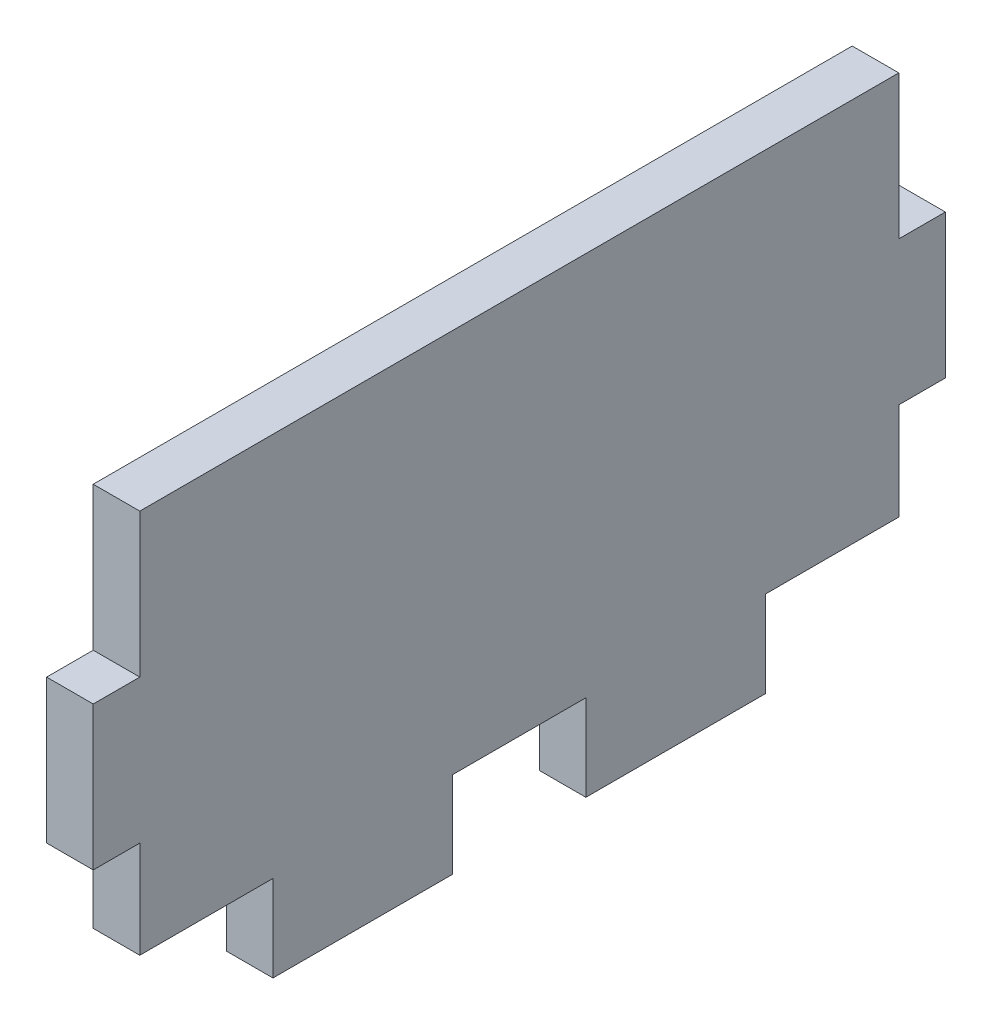
ISO-10303-21;
HEADER;
FILE_DESCRIPTION(('STEP AP214'),'2;1');
FILE_NAME('part.step','',(''),(''),'','','');
FILE_SCHEMA(('AUTOMOTIVE_DESIGN { 1 0 10303 214 1 1 1 1 }'));
ENDSEC;
DATA;
#1=APPLICATION_CONTEXT('core data for automotive mechanical design processes');
#2=APPLICATION_PROTOCOL_DEFINITION('international standard','automotive_design',2000,#1);
#3=PRODUCT_CONTEXT('',#1,'mechanical');
#4=PRODUCT('Part','Part','',(#3));
#5=PRODUCT_RELATED_PRODUCT_CATEGORY('part','',(#4));
#6=PRODUCT_DEFINITION_FORMATION('','',#4);
#7=PRODUCT_DEFINITION_CONTEXT('part definition',#1,'design');
#8=PRODUCT_DEFINITION('design','',#6,#7);
#9=PRODUCT_DEFINITION_SHAPE('','',#8);
#10=(LENGTH_UNIT() NAMED_UNIT(*) SI_UNIT(.MILLI.,.METRE.));
#11=(NAMED_UNIT(*) PLANE_ANGLE_UNIT() SI_UNIT($,.RADIAN.));
#12=(NAMED_UNIT(*) SI_UNIT($,.STERADIAN.) SOLID_ANGLE_UNIT());
#13=UNCERTAINTY_MEASURE_WITH_UNIT(LENGTH_MEASURE(1.E-05),#10,'distance_accuracy_value','');
#14=(GEOMETRIC_REPRESENTATION_CONTEXT(3) GLOBAL_UNCERTAINTY_ASSIGNED_CONTEXT((#13)) GLOBAL_UNIT_ASSIGNED_CONTEXT((#10,
#11,#12)) REPRESENTATION_CONTEXT('',''));
#15=CARTESIAN_POINT('',(0.,0.,0.));
#16=DIRECTION('',(0.,0.,1.));
#17=DIRECTION('',(1.,0.,0.));
#18=AXIS2_PLACEMENT_3D('',#15,#16,#17);
#19=CARTESIAN_POINT('',(2.7,4.16666666666667,-22.));
#20=DIRECTION('',(0.,0.,1.));
#21=DIRECTION('',(0.,-1.,0.));
#22=AXIS2_PLACEMENT_3D('',#19,#20,#21);
#23=PLANE('',#22);
#24=DIRECTION('',(0.,1.,0.));
#25=VECTOR('',#24,1.);
#26=CARTESIAN_POINT('',(0.,4.16666666666667,-22.));
#27=LINE('',#26,#25);
#28=CARTESIAN_POINT('',(0.,4.16666666666667,-22.));
#29=VERTEX_POINT('',#28);
#30=CARTESIAN_POINT('',(0.,12.5,-22.));
#31=VERTEX_POINT('',#30);
#32=EDGE_CURVE('E201',#29,#31,#27,.T.);
#33=ORIENTED_EDGE('',*,*,#32,.T.);
#34=DIRECTION('',(-1.,0.,0.));
#35=VECTOR('',#34,1.);
#36=CARTESIAN_POINT('',(2.7,12.5,-22.));
#37=LINE('',#36,#35);
#38=CARTESIAN_POINT('',(2.7,12.5,-22.));
#39=VERTEX_POINT('',#38);
#40=EDGE_CURVE('E11',#39,#31,#37,.T.);
#41=ORIENTED_EDGE('',*,*,#40,.F.);
#42=DIRECTION('',(0.,1.,0.));
#43=VECTOR('',#42,1.);
#44=CARTESIAN_POINT('',(2.7,4.16666666666667,-22.));
#45=LINE('',#44,#43);
#46=CARTESIAN_POINT('',(2.7,4.16666666666667,-22.));
#47=VERTEX_POINT('',#46);
#48=EDGE_CURVE('E243',#47,#39,#45,.T.);
#49=ORIENTED_EDGE('',*,*,#48,.F.);
#50=DIRECTION('',(-1.,0.,0.));
#51=VECTOR('',#50,1.);
#52=CARTESIAN_POINT('',(2.7,4.16666666666667,-22.));
#53=LINE('',#52,#51);
#54=EDGE_CURVE('E197',#47,#29,#53,.T.);
#55=ORIENTED_EDGE('',*,*,#54,.T.);
#56=EDGE_LOOP('',(#33,#41,#49,#55));
#57=FACE_BOUND('',#56,.T.);
#58=ADVANCED_FACE('F33',(#57),#23,.F.);
#59=CARTESIAN_POINT('',(2.7,12.5,-22.));
#60=DIRECTION('',(0.,-1.,0.));
#61=DIRECTION('',(0.,0.,-1.));
#62=AXIS2_PLACEMENT_3D('',#59,#60,#61);
#63=PLANE('',#62);
#64=DIRECTION('',(0.,0.,1.));
#65=VECTOR('',#64,1.);
#66=CARTESIAN_POINT('',(0.,12.5,-22.));
#67=LINE('',#66,#65);
#68=CARTESIAN_POINT('',(0.,12.5,22.));
#69=VERTEX_POINT('',#68);
#70=EDGE_CURVE('E204',#31,#69,#67,.T.);
#71=ORIENTED_EDGE('',*,*,#70,.T.);
#72=DIRECTION('',(-1.,0.,0.));
#73=VECTOR('',#72,1.);
#74=CARTESIAN_POINT('',(2.7,12.5,22.));
#75=LINE('',#74,#73);
#76=CARTESIAN_POINT('',(2.7,12.5,22.));
#77=VERTEX_POINT('',#76);
#78=EDGE_CURVE('E41',#77,#69,#75,.T.);
#79=ORIENTED_EDGE('',*,*,#78,.F.);
#80=DIRECTION('',(0.,0.,1.));
#81=VECTOR('',#80,1.);
#82=CARTESIAN_POINT('',(2.7,12.5,-22.));
#83=LINE('',#82,#81);
#84=EDGE_CURVE('E128',#39,#77,#83,.T.);
#85=ORIENTED_EDGE('',*,*,#84,.F.);
#86=ORIENTED_EDGE('',*,*,#40,.T.);
#87=EDGE_LOOP('',(#71,#79,#85,#86));
#88=FACE_BOUND('',#87,.T.);
#89=ADVANCED_FACE('F361',(#88),#63,.F.);
#90=CARTESIAN_POINT('',(2.7,4.16666666666665,22.));
#91=DIRECTION('',(0.,0.,-1.));
#92=DIRECTION('',(-1.,0.,0.));
#93=AXIS2_PLACEMENT_3D('',#90,#91,#92);
#94=PLANE('',#93);
#95=DIRECTION('',(0.,-1.,0.));
#96=VECTOR('',#95,1.);
#97=CARTESIAN_POINT('',(0.,4.16666666666665,22.));
#98=LINE('',#97,#96);
#99=CARTESIAN_POINT('',(0.,4.16666666666665,22.));
#100=VERTEX_POINT('',#99);
#101=EDGE_CURVE('E206',#69,#100,#98,.T.);
#102=ORIENTED_EDGE('',*,*,#101,.T.);
#103=DIRECTION('',(-1.,0.,0.));
#104=VECTOR('',#103,1.);
#105=CARTESIAN_POINT('',(2.7,4.16666666666665,22.));
#106=LINE('',#105,#104);
#107=CARTESIAN_POINT('',(2.7,4.16666666666665,22.));
#108=VERTEX_POINT('',#107);
#109=EDGE_CURVE('E286',#108,#100,#106,.T.);
#110=ORIENTED_EDGE('',*,*,#109,.F.);
#111=DIRECTION('',(0.,-1.,0.));
#112=VECTOR('',#111,1.);
#113=CARTESIAN_POINT('',(2.7,4.16666666666665,22.));
#114=LINE('',#113,#112);
#115=EDGE_CURVE('E294',#77,#108,#114,.T.);
#116=ORIENTED_EDGE('',*,*,#115,.F.);
#117=ORIENTED_EDGE('',*,*,#78,.T.);
#118=EDGE_LOOP('',(#102,#110,#116,#117));
#119=FACE_BOUND('',#118,.T.);
#120=ADVANCED_FACE('F292',(#119),#94,.F.);
#121=CARTESIAN_POINT('',(2.7,4.16666666666665,24.7));
#122=DIRECTION('',(0.,-1.,0.));
#123=DIRECTION('',(0.,0.,-1.));
#124=AXIS2_PLACEMENT_3D('',#121,#122,#123);
#125=PLANE('',#124);
#126=DIRECTION('',(0.,0.,1.));
#127=VECTOR('',#126,1.);
#128=CARTESIAN_POINT('',(0.,4.16666666666665,24.7));
#129=LINE('',#128,#127);
#130=CARTESIAN_POINT('',(0.,4.16666666666665,24.7));
#131=VERTEX_POINT('',#130);
#132=EDGE_CURVE('E208',#100,#131,#129,.T.);
#133=ORIENTED_EDGE('',*,*,#132,.T.);
#134=DIRECTION('',(-1.,0.,0.));
#135=VECTOR('',#134,1.);
#136=CARTESIAN_POINT('',(2.7,4.16666666666665,24.7));
#137=LINE('',#136,#135);
#138=CARTESIAN_POINT('',(2.7,4.16666666666665,24.7));
#139=VERTEX_POINT('',#138);
#140=EDGE_CURVE('E283',#139,#131,#137,.T.);
#141=ORIENTED_EDGE('',*,*,#140,.F.);
#142=DIRECTION('',(0.,0.,1.));
#143=VECTOR('',#142,1.);
#144=CARTESIAN_POINT('',(2.7,4.16666666666665,24.7));
#145=LINE('',#144,#143);
#146=EDGE_CURVE('E312',#108,#139,#145,.T.);
#147=ORIENTED_EDGE('',*,*,#146,.F.);
#148=ORIENTED_EDGE('',*,*,#109,.T.);
#149=EDGE_LOOP('',(#133,#141,#147,#148));
#150=FACE_BOUND('',#149,.T.);
#151=ADVANCED_FACE('F303',(#150),#125,.F.);
#152=CARTESIAN_POINT('',(2.7,-4.16666666666668,24.7));
#153=DIRECTION('',(0.,0.,-1.));
#154=DIRECTION('',(-1.,0.,0.));
#155=AXIS2_PLACEMENT_3D('',#152,#153,#154);
#156=PLANE('',#155);
#157=DIRECTION('',(0.,-1.,0.));
#158=VECTOR('',#157,1.);
#159=CARTESIAN_POINT('',(0.,-4.16666666666668,24.7));
#160=LINE('',#159,#158);
#161=CARTESIAN_POINT('',(0.,-4.16666666666668,24.7));
#162=VERTEX_POINT('',#161);
#163=EDGE_CURVE('E210',#131,#162,#160,.T.);
#164=ORIENTED_EDGE('',*,*,#163,.T.);
#165=DIRECTION('',(-1.,0.,0.));
#166=VECTOR('',#165,1.);
#167=CARTESIAN_POINT('',(2.7,-4.16666666666668,24.7));
#168=LINE('',#167,#166);
#169=CARTESIAN_POINT('',(2.7,-4.16666666666668,24.7));
#170=VERTEX_POINT('',#169);
#171=EDGE_CURVE('E280',#170,#162,#168,.T.);
#172=ORIENTED_EDGE('',*,*,#171,.F.);
#173=DIRECTION('',(0.,-1.,0.));
#174=VECTOR('',#173,1.);
#175=CARTESIAN_POINT('',(2.7,-4.16666666666668,24.7));
#176=LINE('',#175,#174);
#177=EDGE_CURVE('E309',#139,#170,#176,.T.);
#178=ORIENTED_EDGE('',*,*,#177,.F.);
#179=ORIENTED_EDGE('',*,*,#140,.T.);
#180=EDGE_LOOP('',(#164,#172,#178,#179));
#181=FACE_BOUND('',#180,.T.);
#182=ADVANCED_FACE('F307',(#181),#156,.F.);
#183=CARTESIAN_POINT('',(2.7,-4.16666666666668,24.7));
#184=DIRECTION('',(0.,1.,0.));
#185=DIRECTION('',(0.,0.,1.));
#186=AXIS2_PLACEMENT_3D('',#183,#184,#185);
#187=PLANE('',#186);
#188=DIRECTION('',(0.,0.,-1.));
#189=VECTOR('',#188,1.);
#190=CARTESIAN_POINT('',(0.,-4.16666666666668,24.7));
#191=LINE('',#190,#189);
#192=CARTESIAN_POINT('',(0.,-4.16666666666668,22.));
#193=VERTEX_POINT('',#192);
#194=EDGE_CURVE('E212',#162,#193,#191,.T.);
#195=ORIENTED_EDGE('',*,*,#194,.T.);
#196=DIRECTION('',(-1.,0.,0.));
#197=VECTOR('',#196,1.);
#198=CARTESIAN_POINT('',(2.7,-4.16666666666668,22.));
#199=LINE('',#198,#197);
#200=CARTESIAN_POINT('',(2.7,-4.16666666666668,22.));
#201=VERTEX_POINT('',#200);
#202=EDGE_CURVE('E277',#201,#193,#199,.T.);
#203=ORIENTED_EDGE('',*,*,#202,.F.);
#204=DIRECTION('',(0.,0.,-1.));
#205=VECTOR('',#204,1.);
#206=CARTESIAN_POINT('',(2.7,-4.16666666666668,24.7));
#207=LINE('',#206,#205);
#208=EDGE_CURVE('E311',#170,#201,#207,.T.);
#209=ORIENTED_EDGE('',*,*,#208,.F.);
#210=ORIENTED_EDGE('',*,*,#171,.T.);
#211=EDGE_LOOP('',(#195,#203,#209,#210));
#212=FACE_BOUND('',#211,.T.);
#213=ADVANCED_FACE('F374',(#212),#187,.F.);
#214=CARTESIAN_POINT('',(2.7,-4.16666666666668,22.));
#215=DIRECTION('',(0.,0.,-1.));
#216=DIRECTION('',(-1.,0.,0.));
#217=AXIS2_PLACEMENT_3D('',#214,#215,#216);
#218=PLANE('',#217);
#219=DIRECTION('',(0.,-1.,0.));
#220=VECTOR('',#219,1.);
#221=CARTESIAN_POINT('',(0.,-4.16666666666668,22.));
#222=LINE('',#221,#220);
#223=CARTESIAN_POINT('',(0.,-9.80000000000001,22.));
#224=VERTEX_POINT('',#223);
#225=EDGE_CURVE('E214',#193,#224,#222,.T.);
#226=ORIENTED_EDGE('',*,*,#225,.T.);
#227=DIRECTION('',(-1.,0.,0.));
#228=VECTOR('',#227,1.);
#229=CARTESIAN_POINT('',(2.7,-9.80000000000001,22.));
#230=LINE('',#229,#228);
#231=CARTESIAN_POINT('',(2.7,-9.80000000000001,22.));
#232=VERTEX_POINT('',#231);
#233=EDGE_CURVE('E274',#232,#224,#230,.T.);
#234=ORIENTED_EDGE('',*,*,#233,.F.);
#235=DIRECTION('',(0.,-1.,0.));
#236=VECTOR('',#235,1.);
#237=CARTESIAN_POINT('',(2.7,-4.16666666666668,22.));
#238=LINE('',#237,#236);
#239=EDGE_CURVE('E314',#201,#232,#238,.T.);
#240=ORIENTED_EDGE('',*,*,#239,.F.);
#241=ORIENTED_EDGE('',*,*,#202,.T.);
#242=EDGE_LOOP('',(#226,#234,#240,#241));
#243=FACE_BOUND('',#242,.T.);
#244=ADVANCED_FACE('F377',(#243),#218,.F.);
#245=CARTESIAN_POINT('',(2.7,-9.80000000000001,22.));
#246=DIRECTION('',(0.,1.,0.));
#247=DIRECTION('',(0.,0.,1.));
#248=AXIS2_PLACEMENT_3D('',#245,#246,#247);
#249=PLANE('',#248);
#250=DIRECTION('',(0.,0.,-1.));
#251=VECTOR('',#250,1.);
#252=CARTESIAN_POINT('',(0.,-9.80000000000001,22.));
#253=LINE('',#252,#251);
#254=CARTESIAN_POINT('',(0.,-9.80000000000001,14.28));
#255=VERTEX_POINT('',#254);
#256=EDGE_CURVE('E216',#224,#255,#253,.T.);
#257=ORIENTED_EDGE('',*,*,#256,.T.);
#258=DIRECTION('',(-1.,0.,0.));
#259=VECTOR('',#258,1.);
#260=CARTESIAN_POINT('',(2.7,-9.80000000000001,14.28));
#261=LINE('',#260,#259);
#262=CARTESIAN_POINT('',(2.7,-9.80000000000001,14.28));
#263=VERTEX_POINT('',#262);
#264=EDGE_CURVE('E271',#263,#255,#261,.T.);
#265=ORIENTED_EDGE('',*,*,#264,.F.);
#266=DIRECTION('',(0.,0.,-1.));
#267=VECTOR('',#266,1.);
#268=CARTESIAN_POINT('',(2.7,-9.80000000000001,22.));
#269=LINE('',#268,#267);
#270=EDGE_CURVE('E320',#232,#263,#269,.T.);
#271=ORIENTED_EDGE('',*,*,#270,.F.);
#272=ORIENTED_EDGE('',*,*,#233,.T.);
#273=EDGE_LOOP('',(#257,#265,#271,#272));
#274=FACE_BOUND('',#273,.T.);
#275=ADVANCED_FACE('F381',(#274),#249,.F.);
#276=CARTESIAN_POINT('',(2.7,-12.5,14.28));
#277=DIRECTION('',(0.,0.,-1.));
#278=DIRECTION('',(-1.,0.,0.));
#279=AXIS2_PLACEMENT_3D('',#276,#277,#278);
#280=PLANE('',#279);
#281=DIRECTION('',(0.,-1.,0.));
#282=VECTOR('',#281,1.);
#283=CARTESIAN_POINT('',(0.,-12.5,14.28));
#284=LINE('',#283,#282);
#285=CARTESIAN_POINT('',(0.,-14.8,14.28));
#286=VERTEX_POINT('',#285);
#287=EDGE_CURVE('E219',#255,#286,#284,.T.);
#288=ORIENTED_EDGE('',*,*,#287,.T.);
#289=DIRECTION('',(-1.,0.,0.));
#290=VECTOR('',#289,1.);
#291=CARTESIAN_POINT('',(2.7,-14.8,14.28));
#292=LINE('',#291,#290);
#293=CARTESIAN_POINT('',(2.7,-14.8,14.28));
#294=VERTEX_POINT('',#293);
#295=EDGE_CURVE('E268',#294,#286,#292,.T.);
#296=ORIENTED_EDGE('',*,*,#295,.F.);
#297=DIRECTION('',(0.,-1.,0.));
#298=VECTOR('',#297,1.);
#299=CARTESIAN_POINT('',(2.7,-12.5,14.28));
#300=LINE('',#299,#298);
#301=EDGE_CURVE('E322',#263,#294,#300,.T.);
#302=ORIENTED_EDGE('',*,*,#301,.F.);
#303=ORIENTED_EDGE('',*,*,#264,.T.);
#304=EDGE_LOOP('',(#288,#296,#302,#303));
#305=FACE_BOUND('',#304,.T.);
#306=ADVANCED_FACE('F385',(#305),#280,.F.);
#307=CARTESIAN_POINT('',(2.7,-14.8,14.28));
#308=DIRECTION('',(0.,1.,0.));
#309=DIRECTION('',(0.,0.,1.));
#310=AXIS2_PLACEMENT_3D('',#307,#308,#309);
#311=PLANE('',#310);
#312=DIRECTION('',(0.,0.,-1.));
#313=VECTOR('',#312,1.);
#314=CARTESIAN_POINT('',(0.,-14.8,14.28));
#315=LINE('',#314,#313);
#316=CARTESIAN_POINT('',(0.,-14.8,3.85999999999999));
#317=VERTEX_POINT('',#316);
#318=EDGE_CURVE('E221',#286,#317,#315,.T.);
#319=ORIENTED_EDGE('',*,*,#318,.T.);
#320=DIRECTION('',(-1.,0.,0.));
#321=VECTOR('',#320,1.);
#322=CARTESIAN_POINT('',(2.7,-14.8,3.85999999999999));
#323=LINE('',#322,#321);
#324=CARTESIAN_POINT('',(2.7,-14.8,3.85999999999999));
#325=VERTEX_POINT('',#324);
#326=EDGE_CURVE('E265',#325,#317,#323,.T.);
#327=ORIENTED_EDGE('',*,*,#326,.F.);
#328=DIRECTION('',(0.,0.,-1.));
#329=VECTOR('',#328,1.);
#330=CARTESIAN_POINT('',(2.7,-14.8,14.28));
#331=LINE('',#330,#329);
#332=EDGE_CURVE('E324',#294,#325,#331,.T.);
#333=ORIENTED_EDGE('',*,*,#332,.F.);
#334=ORIENTED_EDGE('',*,*,#295,.T.);
#335=EDGE_LOOP('',(#319,#327,#333,#334));
#336=FACE_BOUND('',#335,.T.);
#337=ADVANCED_FACE('F389',(#336),#311,.F.);
#338=CARTESIAN_POINT('',(2.7,-9.80000000000001,3.85999999999999));
#339=DIRECTION('',(0.,0.,1.));
#340=DIRECTION('',(1.,0.,0.));
#341=AXIS2_PLACEMENT_3D('',#338,#339,#340);
#342=PLANE('',#341);
#343=DIRECTION('',(0.,1.,0.));
#344=VECTOR('',#343,1.);
#345=CARTESIAN_POINT('',(0.,-9.80000000000001,3.85999999999999));
#346=LINE('',#345,#344);
#347=CARTESIAN_POINT('',(0.,-9.80000000000001,3.85999999999999));
#348=VERTEX_POINT('',#347);
#349=EDGE_CURVE('E224',#317,#348,#346,.T.);
#350=ORIENTED_EDGE('',*,*,#349,.T.);
#351=DIRECTION('',(-1.,0.,0.));
#352=VECTOR('',#351,1.);
#353=CARTESIAN_POINT('',(2.7,-9.80000000000001,3.85999999999999));
#354=LINE('',#353,#352);
#355=CARTESIAN_POINT('',(2.7,-9.80000000000001,3.85999999999999));
#356=VERTEX_POINT('',#355);
#357=EDGE_CURVE('E262',#356,#348,#354,.T.);
#358=ORIENTED_EDGE('',*,*,#357,.F.);
#359=DIRECTION('',(0.,1.,0.));
#360=VECTOR('',#359,1.);
#361=CARTESIAN_POINT('',(2.7,-12.5,3.85999999999999));
#362=LINE('',#361,#360);
#363=EDGE_CURVE('E326',#325,#356,#362,.T.);
#364=ORIENTED_EDGE('',*,*,#363,.F.);
#365=ORIENTED_EDGE('',*,*,#326,.T.);
#366=EDGE_LOOP('',(#350,#358,#364,#365));
#367=FACE_BOUND('',#366,.T.);
#368=ADVANCED_FACE('F393',(#367),#342,.F.);
#369=CARTESIAN_POINT('',(2.7,-9.80000000000001,3.85999999999999));
#370=DIRECTION('',(0.,1.,0.));
#371=DIRECTION('',(0.,0.,1.));
#372=AXIS2_PLACEMENT_3D('',#369,#370,#371);
#373=PLANE('',#372);
#374=DIRECTION('',(0.,0.,-1.));
#375=VECTOR('',#374,1.);
#376=CARTESIAN_POINT('',(0.,-9.80000000000001,3.85999999999999));
#377=LINE('',#376,#375);
#378=CARTESIAN_POINT('',(0.,-9.8,-3.86000000000001));
#379=VERTEX_POINT('',#378);
#380=EDGE_CURVE('E226',#348,#379,#377,.T.);
#381=ORIENTED_EDGE('',*,*,#380,.T.);
#382=DIRECTION('',(-1.,0.,0.));
#383=VECTOR('',#382,1.);
#384=CARTESIAN_POINT('',(2.7,-9.8,-3.86000000000001));
#385=LINE('',#384,#383);
#386=CARTESIAN_POINT('',(2.7,-9.8,-3.86000000000001));
#387=VERTEX_POINT('',#386);
#388=EDGE_CURVE('E259',#387,#379,#385,.T.);
#389=ORIENTED_EDGE('',*,*,#388,.F.);
#390=DIRECTION('',(0.,0.,-1.));
#391=VECTOR('',#390,1.);
#392=CARTESIAN_POINT('',(2.7,-9.80000000000001,3.85999999999999));
#393=LINE('',#392,#391);
#394=EDGE_CURVE('E328',#356,#387,#393,.T.);
#395=ORIENTED_EDGE('',*,*,#394,.F.);
#396=ORIENTED_EDGE('',*,*,#357,.T.);
#397=EDGE_LOOP('',(#381,#389,#395,#396));
#398=FACE_BOUND('',#397,.T.);
#399=ADVANCED_FACE('F397',(#398),#373,.F.);
#400=CARTESIAN_POINT('',(2.7,-12.5,-3.86000000000001));
#401=DIRECTION('',(0.,0.,-1.));
#402=DIRECTION('',(0.,1.,0.));
#403=AXIS2_PLACEMENT_3D('',#400,#401,#402);
#404=PLANE('',#403);
#405=DIRECTION('',(0.,-1.,0.));
#406=VECTOR('',#405,1.);
#407=CARTESIAN_POINT('',(0.,-12.5,-3.86000000000001));
#408=LINE('',#407,#406);
#409=CARTESIAN_POINT('',(0.,-14.8,-3.86000000000001));
#410=VERTEX_POINT('',#409);
#411=EDGE_CURVE('E229',#379,#410,#408,.T.);
#412=ORIENTED_EDGE('',*,*,#411,.T.);
#413=DIRECTION('',(-1.,0.,0.));
#414=VECTOR('',#413,1.);
#415=CARTESIAN_POINT('',(2.7,-14.8,-3.86000000000001));
#416=LINE('',#415,#414);
#417=CARTESIAN_POINT('',(2.7,-14.8,-3.86000000000001));
#418=VERTEX_POINT('',#417);
#419=EDGE_CURVE('E256',#418,#410,#416,.T.);
#420=ORIENTED_EDGE('',*,*,#419,.F.);
#421=DIRECTION('',(0.,-1.,0.));
#422=VECTOR('',#421,1.);
#423=CARTESIAN_POINT('',(2.7,-9.8,-3.86000000000001));
#424=LINE('',#423,#422);
#425=EDGE_CURVE('E330',#387,#418,#424,.T.);
#426=ORIENTED_EDGE('',*,*,#425,.F.);
#427=ORIENTED_EDGE('',*,*,#388,.T.);
#428=EDGE_LOOP('',(#412,#420,#426,#427));
#429=FACE_BOUND('',#428,.T.);
#430=ADVANCED_FACE('F401',(#429),#404,.F.);
#431=CARTESIAN_POINT('',(2.7,-14.8,-3.86000000000001));
#432=DIRECTION('',(0.,1.,0.));
#433=DIRECTION('',(0.,0.,1.));
#434=AXIS2_PLACEMENT_3D('',#431,#432,#433);
#435=PLANE('',#434);
#436=DIRECTION('',(0.,0.,-1.));
#437=VECTOR('',#436,1.);
#438=CARTESIAN_POINT('',(0.,-14.8,-3.86000000000001));
#439=LINE('',#438,#437);
#440=CARTESIAN_POINT('',(0.,-14.8,-14.28));
#441=VERTEX_POINT('',#440);
#442=EDGE_CURVE('E231',#410,#441,#439,.T.);
#443=ORIENTED_EDGE('',*,*,#442,.T.);
#444=DIRECTION('',(-1.,0.,0.));
#445=VECTOR('',#444,1.);
#446=CARTESIAN_POINT('',(2.7,-14.8,-14.28));
#447=LINE('',#446,#445);
#448=CARTESIAN_POINT('',(2.7,-14.8,-14.28));
#449=VERTEX_POINT('',#448);
#450=EDGE_CURVE('E253',#449,#441,#447,.T.);
#451=ORIENTED_EDGE('',*,*,#450,.F.);
#452=DIRECTION('',(0.,0.,-1.));
#453=VECTOR('',#452,1.);
#454=CARTESIAN_POINT('',(2.7,-14.8,-3.86000000000001));
#455=LINE('',#454,#453);
#456=EDGE_CURVE('E332',#418,#449,#455,.T.);
#457=ORIENTED_EDGE('',*,*,#456,.F.);
#458=ORIENTED_EDGE('',*,*,#419,.T.);
#459=EDGE_LOOP('',(#443,#451,#457,#458));
#460=FACE_BOUND('',#459,.T.);
#461=ADVANCED_FACE('F405',(#460),#435,.F.);
#462=CARTESIAN_POINT('',(2.7,-12.5,-14.28));
#463=DIRECTION('',(0.,0.,1.));
#464=DIRECTION('',(0.,-1.,0.));
#465=AXIS2_PLACEMENT_3D('',#462,#463,#464);
#466=PLANE('',#465);
#467=DIRECTION('',(0.,1.,0.));
#468=VECTOR('',#467,1.);
#469=CARTESIAN_POINT('',(0.,-12.5,-14.28));
#470=LINE('',#469,#468);
#471=CARTESIAN_POINT('',(0.,-9.8,-14.28));
#472=VERTEX_POINT('',#471);
#473=EDGE_CURVE('E234',#441,#472,#470,.T.);
#474=ORIENTED_EDGE('',*,*,#473,.T.);
#475=DIRECTION('',(-1.,0.,0.));
#476=VECTOR('',#475,1.);
#477=CARTESIAN_POINT('',(2.7,-9.8,-14.28));
#478=LINE('',#477,#476);
#479=CARTESIAN_POINT('',(2.7,-9.8,-14.28));
#480=VERTEX_POINT('',#479);
#481=EDGE_CURVE('E250',#480,#472,#478,.T.);
#482=ORIENTED_EDGE('',*,*,#481,.F.);
#483=DIRECTION('',(0.,1.,0.));
#484=VECTOR('',#483,1.);
#485=CARTESIAN_POINT('',(2.7,-14.8,-14.28));
#486=LINE('',#485,#484);
#487=EDGE_CURVE('E334',#449,#480,#486,.T.);
#488=ORIENTED_EDGE('',*,*,#487,.F.);
#489=ORIENTED_EDGE('',*,*,#450,.T.);
#490=EDGE_LOOP('',(#474,#482,#488,#489));
#491=FACE_BOUND('',#490,.T.);
#492=ADVANCED_FACE('F409',(#491),#466,.F.);
#493=CARTESIAN_POINT('',(2.7,-9.79999999999999,-22.));
#494=DIRECTION('',(0.,1.,0.));
#495=DIRECTION('',(0.,0.,1.));
#496=AXIS2_PLACEMENT_3D('',#493,#494,#495);
#497=PLANE('',#496);
#498=DIRECTION('',(0.,0.,-1.));
#499=VECTOR('',#498,1.);
#500=CARTESIAN_POINT('',(0.,-9.79999999999999,-22.));
#501=LINE('',#500,#499);
#502=CARTESIAN_POINT('',(0.,-9.79999999999999,-22.));
#503=VERTEX_POINT('',#502);
#504=EDGE_CURVE('E236',#472,#503,#501,.T.);
#505=ORIENTED_EDGE('',*,*,#504,.T.);
#506=DIRECTION('',(-1.,0.,0.));
#507=VECTOR('',#506,1.);
#508=CARTESIAN_POINT('',(2.7,-9.79999999999999,-22.));
#509=LINE('',#508,#507);
#510=CARTESIAN_POINT('',(2.7,-9.79999999999999,-22.));
#511=VERTEX_POINT('',#510);
#512=EDGE_CURVE('E247',#511,#503,#509,.T.);
#513=ORIENTED_EDGE('',*,*,#512,.F.);
#514=DIRECTION('',(0.,0.,-1.));
#515=VECTOR('',#514,1.);
#516=CARTESIAN_POINT('',(2.7,-9.79999999999999,-22.));
#517=LINE('',#516,#515);
#518=EDGE_CURVE('E336',#480,#511,#517,.T.);
#519=ORIENTED_EDGE('',*,*,#518,.F.);
#520=ORIENTED_EDGE('',*,*,#481,.T.);
#521=EDGE_LOOP('',(#505,#513,#519,#520));
#522=FACE_BOUND('',#521,.T.);
#523=ADVANCED_FACE('F342',(#522),#497,.F.);
#524=CARTESIAN_POINT('',(2.7,-4.16666666666667,-22.));
#525=DIRECTION('',(0.,0.,1.));
#526=DIRECTION('',(0.,-1.,0.));
#527=AXIS2_PLACEMENT_3D('',#524,#525,#526);
#528=PLANE('',#527);
#529=DIRECTION('',(0.,1.,0.));
#530=VECTOR('',#529,1.);
#531=CARTESIAN_POINT('',(0.,-4.16666666666667,-22.));
#532=LINE('',#531,#530);
#533=CARTESIAN_POINT('',(0.,-4.16666666666667,-22.));
#534=VERTEX_POINT('',#533);
#535=EDGE_CURVE('E238',#503,#534,#532,.T.);
#536=ORIENTED_EDGE('',*,*,#535,.T.);
#537=DIRECTION('',(-1.,0.,0.));
#538=VECTOR('',#537,1.);
#539=CARTESIAN_POINT('',(2.7,-4.16666666666667,-22.));
#540=LINE('',#539,#538);
#541=CARTESIAN_POINT('',(2.7,-4.16666666666667,-22.));
#542=VERTEX_POINT('',#541);
#543=EDGE_CURVE('E192',#542,#534,#540,.T.);
#544=ORIENTED_EDGE('',*,*,#543,.F.);
#545=DIRECTION('',(0.,1.,0.));
#546=VECTOR('',#545,1.);
#547=CARTESIAN_POINT('',(2.7,-4.16666666666667,-22.));
#548=LINE('',#547,#546);
#549=EDGE_CURVE('E183',#511,#542,#548,.T.);
#550=ORIENTED_EDGE('',*,*,#549,.F.);
#551=ORIENTED_EDGE('',*,*,#512,.T.);
#552=EDGE_LOOP('',(#536,#544,#550,#551));
#553=FACE_BOUND('',#552,.T.);
#554=ADVANCED_FACE('F346',(#553),#528,.F.);
#555=CARTESIAN_POINT('',(2.7,-4.16666666666667,-24.7));
#556=DIRECTION('',(0.,1.,0.));
#557=DIRECTION('',(0.,0.,1.));
#558=AXIS2_PLACEMENT_3D('',#555,#556,#557);
#559=PLANE('',#558);
#560=DIRECTION('',(0.,0.,-1.));
#561=VECTOR('',#560,1.);
#562=CARTESIAN_POINT('',(0.,-4.16666666666667,-24.7));
#563=LINE('',#562,#561);
#564=CARTESIAN_POINT('',(0.,-4.16666666666667,-24.7));
#565=VERTEX_POINT('',#564);
#566=EDGE_CURVE('E191',#534,#565,#563,.T.);
#567=ORIENTED_EDGE('',*,*,#566,.T.);
#568=DIRECTION('',(-1.,0.,0.));
#569=VECTOR('',#568,1.);
#570=CARTESIAN_POINT('',(2.7,-4.16666666666667,-24.7));
#571=LINE('',#570,#569);
#572=CARTESIAN_POINT('',(2.7,-4.16666666666667,-24.7));
#573=VERTEX_POINT('',#572);
#574=EDGE_CURVE('E188',#573,#565,#571,.T.);
#575=ORIENTED_EDGE('',*,*,#574,.F.);
#576=DIRECTION('',(0.,0.,-1.));
#577=VECTOR('',#576,1.);
#578=CARTESIAN_POINT('',(2.7,-4.16666666666667,-24.7));
#579=LINE('',#578,#577);
#580=EDGE_CURVE('E177',#542,#573,#579,.T.);
#581=ORIENTED_EDGE('',*,*,#580,.F.);
#582=ORIENTED_EDGE('',*,*,#543,.T.);
#583=EDGE_LOOP('',(#567,#575,#581,#582));
#584=FACE_BOUND('',#583,.T.);
#585=ADVANCED_FACE('F189',(#584),#559,.F.);
#586=CARTESIAN_POINT('',(2.7,-4.16666666666667,-24.7));
#587=DIRECTION('',(0.,0.,1.));
#588=DIRECTION('',(1.,0.,0.));
#589=AXIS2_PLACEMENT_3D('',#586,#587,#588);
#590=PLANE('',#589);
#591=DIRECTION('',(0.,1.,0.));
#592=VECTOR('',#591,1.);
#593=CARTESIAN_POINT('',(0.,-4.16666666666667,-24.7));
#594=LINE('',#593,#592);
#595=CARTESIAN_POINT('',(0.,4.16666666666667,-24.7));
#596=VERTEX_POINT('',#595);
#597=EDGE_CURVE('E114',#565,#596,#594,.T.);
#598=ORIENTED_EDGE('',*,*,#597,.T.);
#599=DIRECTION('',(-1.,0.,0.));
#600=VECTOR('',#599,1.);
#601=CARTESIAN_POINT('',(2.7,4.16666666666667,-24.7));
#602=LINE('',#601,#600);
#603=CARTESIAN_POINT('',(2.7,4.16666666666667,-24.7));
#604=VERTEX_POINT('',#603);
#605=EDGE_CURVE('E193',#604,#596,#602,.T.);
#606=ORIENTED_EDGE('',*,*,#605,.F.);
#607=DIRECTION('',(0.,1.,0.));
#608=VECTOR('',#607,1.);
#609=CARTESIAN_POINT('',(2.7,-4.16666666666667,-24.7));
#610=LINE('',#609,#608);
#611=EDGE_CURVE('E181',#573,#604,#610,.T.);
#612=ORIENTED_EDGE('',*,*,#611,.F.);
#613=ORIENTED_EDGE('',*,*,#574,.T.);
#614=EDGE_LOOP('',(#598,#606,#612,#613));
#615=FACE_BOUND('',#614,.T.);
#616=ADVANCED_FACE('F195',(#615),#590,.F.);
#617=CARTESIAN_POINT('',(2.7,4.16666666666667,-24.7));
#618=DIRECTION('',(0.,-1.,0.));
#619=DIRECTION('',(0.,0.,-1.));
#620=AXIS2_PLACEMENT_3D('',#617,#618,#619);
#621=PLANE('',#620);
#622=DIRECTION('',(0.,0.,1.));
#623=VECTOR('',#622,1.);
#624=CARTESIAN_POINT('',(0.,4.16666666666667,-24.7));
#625=LINE('',#624,#623);
#626=EDGE_CURVE('E120',#596,#29,#625,.T.);
#627=ORIENTED_EDGE('',*,*,#626,.T.);
#628=ORIENTED_EDGE('',*,*,#54,.F.);
#629=DIRECTION('',(0.,0.,1.));
#630=VECTOR('',#629,1.);
#631=CARTESIAN_POINT('',(2.7,4.16666666666667,-24.7));
#632=LINE('',#631,#630);
#633=EDGE_CURVE('E49',#604,#47,#632,.T.);
#634=ORIENTED_EDGE('',*,*,#633,.F.);
#635=ORIENTED_EDGE('',*,*,#605,.T.);
#636=EDGE_LOOP('',(#627,#628,#634,#635));
#637=FACE_BOUND('',#636,.T.);
#638=ADVANCED_FACE('F350',(#637),#621,.F.);
#639=CARTESIAN_POINT('',(2.7,0.,0.));
#640=DIRECTION('',(1.,0.,0.));
#641=DIRECTION('',(0.,0.,-1.));
#642=AXIS2_PLACEMENT_3D('',#639,#640,#641);
#643=PLANE('',#642);
#644=ORIENTED_EDGE('',*,*,#48,.T.);
#645=ORIENTED_EDGE('',*,*,#84,.T.);
#646=ORIENTED_EDGE('',*,*,#115,.T.);
#647=ORIENTED_EDGE('',*,*,#146,.T.);
#648=ORIENTED_EDGE('',*,*,#177,.T.);
#649=ORIENTED_EDGE('',*,*,#208,.T.);
#650=ORIENTED_EDGE('',*,*,#239,.T.);
#651=ORIENTED_EDGE('',*,*,#270,.T.);
#652=ORIENTED_EDGE('',*,*,#301,.T.);
#653=ORIENTED_EDGE('',*,*,#332,.T.);
#654=ORIENTED_EDGE('',*,*,#363,.T.);
#655=ORIENTED_EDGE('',*,*,#394,.T.);
#656=ORIENTED_EDGE('',*,*,#425,.T.);
#657=ORIENTED_EDGE('',*,*,#456,.T.);
#658=ORIENTED_EDGE('',*,*,#487,.T.);
#659=ORIENTED_EDGE('',*,*,#518,.T.);
#660=ORIENTED_EDGE('',*,*,#549,.T.);
#661=ORIENTED_EDGE('',*,*,#580,.T.);
#662=ORIENTED_EDGE('',*,*,#611,.T.);
#663=ORIENTED_EDGE('',*,*,#633,.T.);
#664=EDGE_LOOP('',(#644,#645,#646,#647,#648,#649,#650,#651,#652,#653,#654,#655,#656,#657,#658,
#659,#660,#661,#662,#663));
#665=FACE_BOUND('',#664,.T.);
#666=ADVANCED_FACE('F179',(#665),#643,.T.);
#667=CARTESIAN_POINT('',(0.,0.,0.));
#668=DIRECTION('',(1.,0.,0.));
#669=DIRECTION('',(0.,0.,-1.));
#670=AXIS2_PLACEMENT_3D('',#667,#668,#669);
#671=PLANE('',#670);
#672=ORIENTED_EDGE('',*,*,#32,.F.);
#673=ORIENTED_EDGE('',*,*,#626,.F.);
#674=ORIENTED_EDGE('',*,*,#597,.F.);
#675=ORIENTED_EDGE('',*,*,#566,.F.);
#676=ORIENTED_EDGE('',*,*,#535,.F.);
#677=ORIENTED_EDGE('',*,*,#504,.F.);
#678=ORIENTED_EDGE('',*,*,#473,.F.);
#679=ORIENTED_EDGE('',*,*,#442,.F.);
#680=ORIENTED_EDGE('',*,*,#411,.F.);
#681=ORIENTED_EDGE('',*,*,#380,.F.);
#682=ORIENTED_EDGE('',*,*,#349,.F.);
#683=ORIENTED_EDGE('',*,*,#318,.F.);
#684=ORIENTED_EDGE('',*,*,#287,.F.);
#685=ORIENTED_EDGE('',*,*,#256,.F.);
#686=ORIENTED_EDGE('',*,*,#225,.F.);
#687=ORIENTED_EDGE('',*,*,#194,.F.);
#688=ORIENTED_EDGE('',*,*,#163,.F.);
#689=ORIENTED_EDGE('',*,*,#132,.F.);
#690=ORIENTED_EDGE('',*,*,#101,.F.);
#691=ORIENTED_EDGE('',*,*,#70,.F.);
#692=EDGE_LOOP('',(#672,#673,#674,#675,#676,#677,#678,#679,#680,#681,#682,#683,#684,#685,#686,
#687,#688,#689,#690,#691));
#693=FACE_BOUND('',#692,.T.);
#694=ADVANCED_FACE('F298',(#693),#671,.F.);
#695=CLOSED_SHELL('',(#58,#89,#120,#151,#182,#213,#244,#275,#306,#337,#368,#399,#430,#461,#492,
#523,#554,#585,#616,#638,#666,#694));
#696=MANIFOLD_SOLID_BREP('B2',#695);
#697=ADVANCED_BREP_SHAPE_REPRESENTATION('',(#18,#696),#14);
#698=SHAPE_DEFINITION_REPRESENTATION(#9,#697);
ENDSEC;
END-ISO-10303-21;
